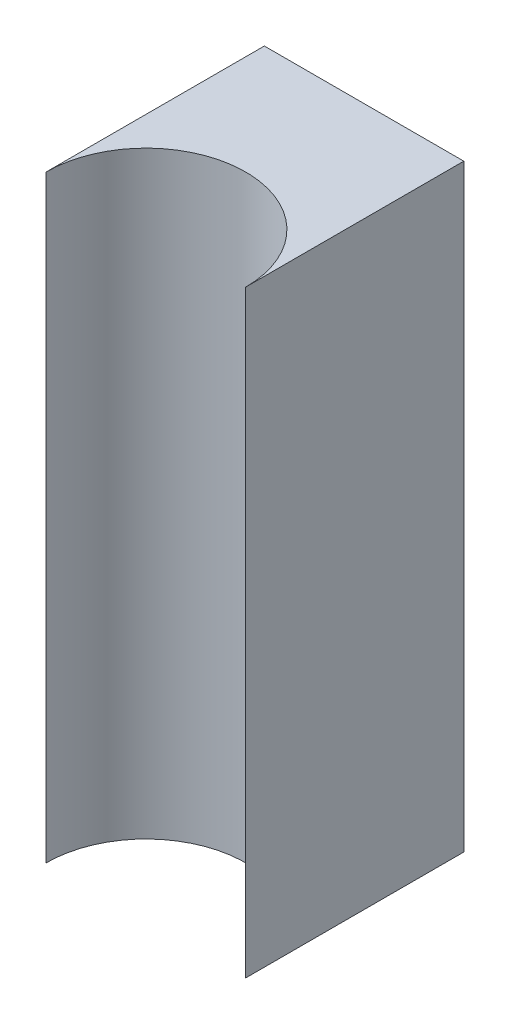
ISO-10303-21;
HEADER;
FILE_DESCRIPTION(('STEP AP214'),'2;1');
FILE_NAME('part.step','',(''),(''),'','','');
FILE_SCHEMA(('AUTOMOTIVE_DESIGN { 1 0 10303 214 1 1 1 1 }'));
ENDSEC;
DATA;
#1=APPLICATION_CONTEXT('core data for automotive mechanical design processes');
#2=APPLICATION_PROTOCOL_DEFINITION('international standard','automotive_design',2000,#1);
#3=PRODUCT_CONTEXT('',#1,'mechanical');
#4=PRODUCT('Part','Part','',(#3));
#5=PRODUCT_RELATED_PRODUCT_CATEGORY('part','',(#4));
#6=PRODUCT_DEFINITION_FORMATION('','',#4);
#7=PRODUCT_DEFINITION_CONTEXT('part definition',#1,'design');
#8=PRODUCT_DEFINITION('design','',#6,#7);
#9=PRODUCT_DEFINITION_SHAPE('','',#8);
#10=(LENGTH_UNIT() NAMED_UNIT(*) SI_UNIT(.MILLI.,.METRE.));
#11=(NAMED_UNIT(*) PLANE_ANGLE_UNIT() SI_UNIT($,.RADIAN.));
#12=(NAMED_UNIT(*) SI_UNIT($,.STERADIAN.) SOLID_ANGLE_UNIT());
#13=UNCERTAINTY_MEASURE_WITH_UNIT(LENGTH_MEASURE(1.E-05),#10,'distance_accuracy_value','');
#14=(GEOMETRIC_REPRESENTATION_CONTEXT(3) GLOBAL_UNCERTAINTY_ASSIGNED_CONTEXT((#13)) GLOBAL_UNIT_ASSIGNED_CONTEXT((#10,
#11,#12)) REPRESENTATION_CONTEXT('',''));
#15=CARTESIAN_POINT('',(0.,0.,0.));
#16=DIRECTION('',(0.,0.,1.));
#17=DIRECTION('',(1.,0.,0.));
#18=AXIS2_PLACEMENT_3D('',#15,#16,#17);
#19=CARTESIAN_POINT('',(164.,22.4999999999996,22.));
#20=DIRECTION('',(1.,0.,0.));
#21=DIRECTION('',(0.,0.,-1.));
#22=AXIS2_PLACEMENT_3D('',#19,#20,#21);
#23=PLANE('',#22);
#24=DIRECTION('',(0.,-1.,0.));
#25=VECTOR('',#24,1.);
#26=CARTESIAN_POINT('',(164.,22.4999999999996,16.4062705283833));
#27=LINE('',#26,#25);
#28=CARTESIAN_POINT('',(164.,22.4999999999996,16.4062705283833));
#29=VERTEX_POINT('',#28);
#30=CARTESIAN_POINT('',(164.,-22.5000000000004,16.4062705283833));
#31=VERTEX_POINT('',#30);
#32=EDGE_CURVE('E80',#29,#31,#27,.T.);
#33=ORIENTED_EDGE('',*,*,#32,.F.);
#34=DIRECTION('',(0.,0.,-1.));
#35=VECTOR('',#34,1.);
#36=CARTESIAN_POINT('',(164.,22.4999999999996,22.));
#37=LINE('',#36,#35);
#38=CARTESIAN_POINT('',(164.,22.4999999999996,0.));
#39=VERTEX_POINT('',#38);
#40=EDGE_CURVE('E11',#29,#39,#37,.T.);
#41=ORIENTED_EDGE('',*,*,#40,.T.);
#42=DIRECTION('',(0.,-1.,0.));
#43=VECTOR('',#42,1.);
#44=CARTESIAN_POINT('',(164.,22.4999999999996,0.));
#45=LINE('',#44,#43);
#46=CARTESIAN_POINT('',(164.,-22.5000000000004,0.));
#47=VERTEX_POINT('',#46);
#48=EDGE_CURVE('E91',#39,#47,#45,.T.);
#49=ORIENTED_EDGE('',*,*,#48,.T.);
#50=DIRECTION('',(0.,0.,-1.));
#51=VECTOR('',#50,1.);
#52=CARTESIAN_POINT('',(164.,-22.5000000000004,22.));
#53=LINE('',#52,#51);
#54=EDGE_CURVE('E42',#31,#47,#53,.T.);
#55=ORIENTED_EDGE('',*,*,#54,.F.);
#56=EDGE_LOOP('',(#33,#41,#49,#55));
#57=FACE_BOUND('',#56,.T.);
#58=ADVANCED_FACE('F33',(#57),#23,.F.);
#59=CARTESIAN_POINT('',(179.,22.4999999999996,22.));
#60=DIRECTION('',(1.,0.,0.));
#61=DIRECTION('',(0.,0.,-1.));
#62=AXIS2_PLACEMENT_3D('',#59,#60,#61);
#63=PLANE('',#62);
#64=DIRECTION('',(0.,0.,-1.));
#65=VECTOR('',#64,1.);
#66=CARTESIAN_POINT('',(179.,22.4999999999996,22.));
#67=LINE('',#66,#65);
#68=CARTESIAN_POINT('',(179.,22.4999999999996,16.4062705283833));
#69=VERTEX_POINT('',#68);
#70=CARTESIAN_POINT('',(179.,22.4999999999996,0.));
#71=VERTEX_POINT('',#70);
#72=EDGE_CURVE('E37',#69,#71,#67,.T.);
#73=ORIENTED_EDGE('',*,*,#72,.F.);
#74=DIRECTION('',(0.,-1.,0.));
#75=VECTOR('',#74,1.);
#76=CARTESIAN_POINT('',(179.,22.4999999999996,16.4062705283833));
#77=LINE('',#76,#75);
#78=CARTESIAN_POINT('',(179.,-22.5000000000004,16.4062705283833));
#79=VERTEX_POINT('',#78);
#80=EDGE_CURVE('E73',#69,#79,#77,.T.);
#81=ORIENTED_EDGE('',*,*,#80,.T.);
#82=DIRECTION('',(0.,0.,-1.));
#83=VECTOR('',#82,1.);
#84=CARTESIAN_POINT('',(179.,-22.5000000000004,22.));
#85=LINE('',#84,#83);
#86=CARTESIAN_POINT('',(179.,-22.5000000000004,0.));
#87=VERTEX_POINT('',#86);
#88=EDGE_CURVE('E90',#79,#87,#85,.T.);
#89=ORIENTED_EDGE('',*,*,#88,.T.);
#90=DIRECTION('',(0.,-1.,0.));
#91=VECTOR('',#90,1.);
#92=CARTESIAN_POINT('',(179.,22.4999999999996,0.));
#93=LINE('',#92,#91);
#94=EDGE_CURVE('E88',#71,#87,#93,.T.);
#95=ORIENTED_EDGE('',*,*,#94,.F.);
#96=EDGE_LOOP('',(#73,#81,#89,#95));
#97=FACE_BOUND('',#96,.T.);
#98=ADVANCED_FACE('F86',(#97),#63,.T.);
#99=CARTESIAN_POINT('',(164.,22.4999999999996,22.));
#100=DIRECTION('',(0.,1.,0.));
#101=DIRECTION('',(0.,0.,1.));
#102=AXIS2_PLACEMENT_3D('',#99,#100,#101);
#103=PLANE('',#102);
#104=CARTESIAN_POINT('',(171.5,22.4999999999996,16.4062705283833));
#105=DIRECTION('',(0.,-1.,0.));
#106=DIRECTION('',(1.,0.,0.));
#107=AXIS2_PLACEMENT_3D('',#104,#105,#106);
#108=CIRCLE('',#107,7.49999999999998);
#109=EDGE_CURVE('E76',#29,#69,#108,.T.);
#110=ORIENTED_EDGE('',*,*,#109,.T.);
#111=ORIENTED_EDGE('',*,*,#72,.T.);
#112=DIRECTION('',(1.,0.,0.));
#113=VECTOR('',#112,1.);
#114=CARTESIAN_POINT('',(164.,22.4999999999996,0.));
#115=LINE('',#114,#113);
#116=EDGE_CURVE('E102',#39,#71,#115,.T.);
#117=ORIENTED_EDGE('',*,*,#116,.F.);
#118=ORIENTED_EDGE('',*,*,#40,.F.);
#119=EDGE_LOOP('',(#110,#111,#117,#118));
#120=FACE_BOUND('',#119,.T.);
#121=ADVANCED_FACE('F35',(#120),#103,.T.);
#122=CARTESIAN_POINT('',(164.,-22.5000000000004,22.));
#123=DIRECTION('',(0.,1.,0.));
#124=DIRECTION('',(0.,0.,1.));
#125=AXIS2_PLACEMENT_3D('',#122,#123,#124);
#126=PLANE('',#125);
#127=ORIENTED_EDGE('',*,*,#88,.F.);
#128=CARTESIAN_POINT('',(171.5,-22.5000000000004,16.4062705283833));
#129=DIRECTION('',(0.,-1.,0.));
#130=DIRECTION('',(1.,0.,0.));
#131=AXIS2_PLACEMENT_3D('',#128,#129,#130);
#132=CIRCLE('',#131,7.49999999999998);
#133=EDGE_CURVE('E50',#31,#79,#132,.T.);
#134=ORIENTED_EDGE('',*,*,#133,.F.);
#135=ORIENTED_EDGE('',*,*,#54,.T.);
#136=DIRECTION('',(1.,0.,0.));
#137=VECTOR('',#136,1.);
#138=CARTESIAN_POINT('',(164.,-22.5000000000004,0.));
#139=LINE('',#138,#137);
#140=EDGE_CURVE('E92',#47,#87,#139,.T.);
#141=ORIENTED_EDGE('',*,*,#140,.T.);
#142=EDGE_LOOP('',(#127,#134,#135,#141));
#143=FACE_BOUND('',#142,.T.);
#144=ADVANCED_FACE('F101',(#143),#126,.F.);
#145=CARTESIAN_POINT('',(0.,0.,0.));
#146=DIRECTION('',(0.,0.,-1.));
#147=DIRECTION('',(-1.,0.,0.));
#148=AXIS2_PLACEMENT_3D('',#145,#146,#147);
#149=PLANE('',#148);
#150=ORIENTED_EDGE('',*,*,#116,.T.);
#151=ORIENTED_EDGE('',*,*,#94,.T.);
#152=ORIENTED_EDGE('',*,*,#140,.F.);
#153=ORIENTED_EDGE('',*,*,#48,.F.);
#154=EDGE_LOOP('',(#150,#151,#152,#153));
#155=FACE_BOUND('',#154,.T.);
#156=ADVANCED_FACE('F107',(#155),#149,.T.);
#157=CARTESIAN_POINT('',(171.5,22.4999999999996,16.4062705283833));
#158=DIRECTION('',(0.,-1.,0.));
#159=DIRECTION('',(1.,0.,0.));
#160=AXIS2_PLACEMENT_3D('',#157,#158,#159);
#161=CYLINDRICAL_SURFACE('',#160,7.49999999999998);
#162=ORIENTED_EDGE('',*,*,#133,.T.);
#163=ORIENTED_EDGE('',*,*,#80,.F.);
#164=ORIENTED_EDGE('',*,*,#109,.F.);
#165=ORIENTED_EDGE('',*,*,#32,.T.);
#166=EDGE_LOOP('',(#162,#163,#164,#165));
#167=FACE_BOUND('',#166,.T.);
#168=ADVANCED_FACE('F75',(#167),#161,.F.);
#169=CLOSED_SHELL('',(#58,#98,#121,#144,#156,#168));
#170=MANIFOLD_SOLID_BREP('B2',#169);
#171=ADVANCED_BREP_SHAPE_REPRESENTATION('',(#18,#170),#14);
#172=SHAPE_DEFINITION_REPRESENTATION(#9,#171);
ENDSEC;
END-ISO-10303-21;
